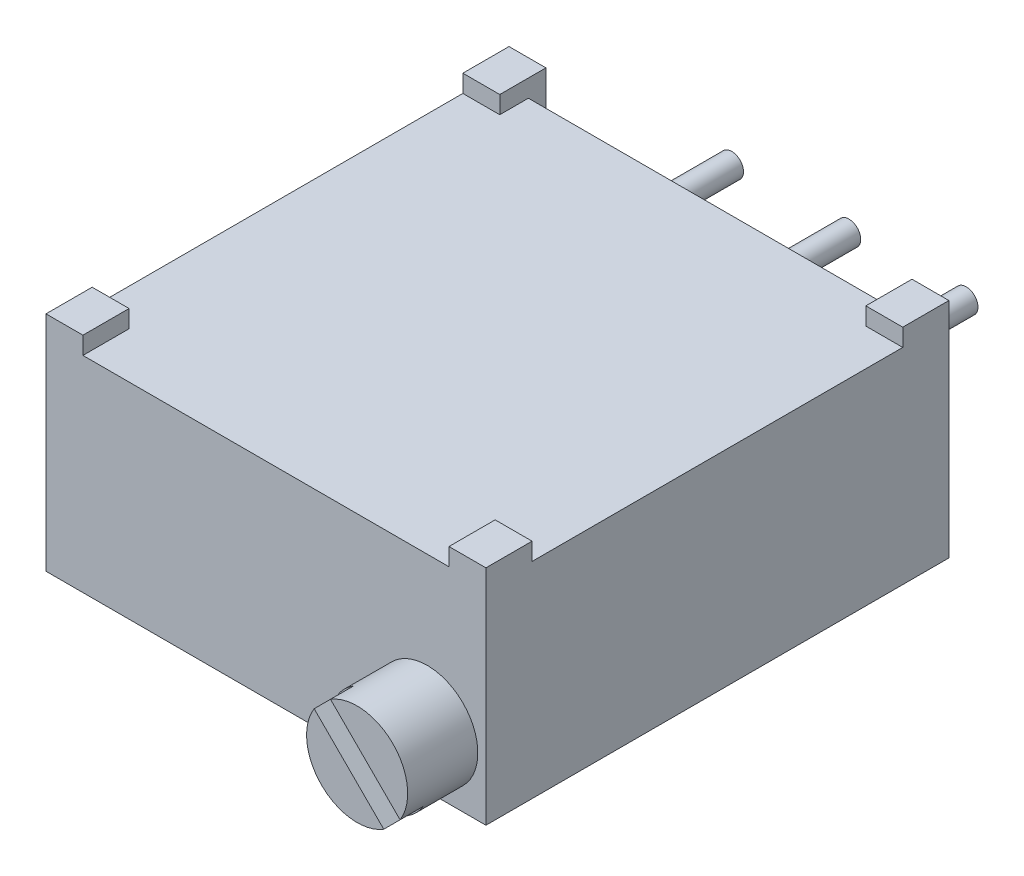
ISO-10303-21;
HEADER;
FILE_DESCRIPTION(('STEP AP214'),'2;1');
FILE_NAME('part.step','',(''),(''),'','','');
FILE_SCHEMA(('AUTOMOTIVE_DESIGN { 1 0 10303 214 1 1 1 1 }'));
ENDSEC;
DATA;
#1=APPLICATION_CONTEXT('core data for automotive mechanical design processes');
#2=APPLICATION_PROTOCOL_DEFINITION('international standard','automotive_design',2000,#1);
#3=PRODUCT_CONTEXT('',#1,'mechanical');
#4=PRODUCT('Part','Part','',(#3));
#5=PRODUCT_RELATED_PRODUCT_CATEGORY('part','',(#4));
#6=PRODUCT_DEFINITION_FORMATION('','',#4);
#7=PRODUCT_DEFINITION_CONTEXT('part definition',#1,'design');
#8=PRODUCT_DEFINITION('design','',#6,#7);
#9=PRODUCT_DEFINITION_SHAPE('','',#8);
#10=(LENGTH_UNIT() NAMED_UNIT(*) SI_UNIT(.MILLI.,.METRE.));
#11=(NAMED_UNIT(*) PLANE_ANGLE_UNIT() SI_UNIT($,.RADIAN.));
#12=(NAMED_UNIT(*) SI_UNIT($,.STERADIAN.) SOLID_ANGLE_UNIT());
#13=UNCERTAINTY_MEASURE_WITH_UNIT(LENGTH_MEASURE(1.E-05),#10,'distance_accuracy_value','');
#14=(GEOMETRIC_REPRESENTATION_CONTEXT(3) GLOBAL_UNCERTAINTY_ASSIGNED_CONTEXT((#13)) GLOBAL_UNIT_ASSIGNED_CONTEXT((#10,
#11,#12)) REPRESENTATION_CONTEXT('',''));
#15=CARTESIAN_POINT('',(0.,0.,0.));
#16=DIRECTION('',(0.,0.,1.));
#17=DIRECTION('',(1.,0.,0.));
#18=AXIS2_PLACEMENT_3D('',#15,#16,#17);
#19=CARTESIAN_POINT('',(3.495,-1.145,11.05));
#20=DIRECTION('',(0.,0.,1.));
#21=DIRECTION('',(1.,0.,0.));
#22=AXIS2_PLACEMENT_3D('',#19,#20,#21);
#23=PLANE('',#22);
#24=CARTESIAN_POINT('',(3.495,-1.145,11.05));
#25=DIRECTION('',(0.,0.,-1.));
#26=DIRECTION('',(-1.,0.,0.));
#27=AXIS2_PLACEMENT_3D('',#24,#25,#26);
#28=CIRCLE('',#27,1.095);
#29=CARTESIAN_POINT('',(4.07205518251167,-2.07560857310495,11.05));
#30=VERTEX_POINT('',#29);
#31=CARTESIAN_POINT('',(4.42560857310494,-1.72205518251167,11.05));
#32=VERTEX_POINT('',#31);
#33=EDGE_CURVE('E172',#30,#32,#28,.F.);
#34=ORIENTED_EDGE('',*,*,#33,.T.);
#35=DIRECTION('',(-0.707106781186546,0.707106781186549,0.));
#36=VECTOR('',#35,1.);
#37=CARTESIAN_POINT('',(2.91794481748833,-0.214391426895054,11.05));
#38=LINE('',#37,#36);
#39=CARTESIAN_POINT('',(2.91794481748833,-0.214391426895054,11.05));
#40=VERTEX_POINT('',#39);
#41=EDGE_CURVE('E175',#32,#40,#38,.T.);
#42=ORIENTED_EDGE('',*,*,#41,.T.);
#43=CARTESIAN_POINT('',(3.495,-1.145,11.05));
#44=DIRECTION('',(0.,0.,-1.));
#45=DIRECTION('',(-1.,0.,0.));
#46=AXIS2_PLACEMENT_3D('',#43,#44,#45);
#47=CIRCLE('',#46,1.095);
#48=CARTESIAN_POINT('',(2.56439142689505,-0.567944817488329,11.05));
#49=VERTEX_POINT('',#48);
#50=EDGE_CURVE('E19',#40,#49,#47,.F.);
#51=ORIENTED_EDGE('',*,*,#50,.T.);
#52=DIRECTION('',(0.707106781186546,-0.707106781186549,0.));
#53=VECTOR('',#52,1.);
#54=CARTESIAN_POINT('',(2.56439142689505,-0.567944817488327,11.05));
#55=LINE('',#54,#53);
#56=EDGE_CURVE('E193',#49,#30,#55,.T.);
#57=ORIENTED_EDGE('',*,*,#56,.T.);
#58=EDGE_LOOP('',(#34,#42,#51,#57));
#59=FACE_BOUND('',#58,.T.);
#60=ADVANCED_FACE('F16',(#59),#23,.T.);
#61=CARTESIAN_POINT('',(2.56439142689505,-0.567944817488327,11.05));
#62=DIRECTION('',(-0.707106781186549,-0.707106781186546,0.));
#63=DIRECTION('',(0.707106781186546,-0.707106781186549,0.));
#64=AXIS2_PLACEMENT_3D('',#61,#62,#63);
#65=PLANE('',#64);
#66=DIRECTION('',(0.,0.,1.));
#67=VECTOR('',#66,1.);
#68=CARTESIAN_POINT('',(4.07205518251167,-2.07560857310495,11.05));
#69=LINE('',#68,#67);
#70=CARTESIAN_POINT('',(4.07205518251167,-2.07560857310495,11.55));
#71=VERTEX_POINT('',#70);
#72=EDGE_CURVE('E191',#30,#71,#69,.T.);
#73=ORIENTED_EDGE('',*,*,#72,.F.);
#74=ORIENTED_EDGE('',*,*,#56,.F.);
#75=DIRECTION('',(0.,0.,1.));
#76=VECTOR('',#75,1.);
#77=CARTESIAN_POINT('',(2.56439142689505,-0.567944817488327,11.05));
#78=LINE('',#77,#76);
#79=CARTESIAN_POINT('',(2.56439142689505,-0.567944817488329,11.55));
#80=VERTEX_POINT('',#79);
#81=EDGE_CURVE('E168',#80,#49,#78,.F.);
#82=ORIENTED_EDGE('',*,*,#81,.F.);
#83=DIRECTION('',(-0.707106781186547,0.707106781186548,0.));
#84=VECTOR('',#83,1.);
#85=CARTESIAN_POINT('',(4.07205518251167,-2.07560857310495,11.55));
#86=LINE('',#85,#84);
#87=EDGE_CURVE('E184',#71,#80,#86,.T.);
#88=ORIENTED_EDGE('',*,*,#87,.F.);
#89=EDGE_LOOP('',(#73,#74,#82,#88));
#90=FACE_BOUND('',#89,.T.);
#91=ADVANCED_FACE('F242',(#90),#65,.F.);
#92=CARTESIAN_POINT('',(2.91794481748833,-0.214391426895054,11.05));
#93=DIRECTION('',(0.707106781186549,0.707106781186546,0.));
#94=DIRECTION('',(-0.707106781186546,0.707106781186549,0.));
#95=AXIS2_PLACEMENT_3D('',#92,#93,#94);
#96=PLANE('',#95);
#97=DIRECTION('',(0.,0.,1.));
#98=VECTOR('',#97,1.);
#99=CARTESIAN_POINT('',(2.91794481748833,-0.214391426895054,11.05));
#100=LINE('',#99,#98);
#101=CARTESIAN_POINT('',(2.91794481748833,-0.214391426895054,11.55));
#102=VERTEX_POINT('',#101);
#103=EDGE_CURVE('E165',#40,#102,#100,.T.);
#104=ORIENTED_EDGE('',*,*,#103,.F.);
#105=ORIENTED_EDGE('',*,*,#41,.F.);
#106=DIRECTION('',(0.,0.,1.));
#107=VECTOR('',#106,1.);
#108=CARTESIAN_POINT('',(4.42560857310494,-1.72205518251167,11.05));
#109=LINE('',#108,#107);
#110=CARTESIAN_POINT('',(4.42560857310494,-1.72205518251167,11.55));
#111=VERTEX_POINT('',#110);
#112=EDGE_CURVE('E178',#111,#32,#109,.F.);
#113=ORIENTED_EDGE('',*,*,#112,.F.);
#114=DIRECTION('',(0.707106781186546,-0.707106781186549,0.));
#115=VECTOR('',#114,1.);
#116=CARTESIAN_POINT('',(2.91794481748833,-0.214391426895054,11.55));
#117=LINE('',#116,#115);
#118=EDGE_CURVE('E182',#102,#111,#117,.T.);
#119=ORIENTED_EDGE('',*,*,#118,.F.);
#120=EDGE_LOOP('',(#104,#105,#113,#119));
#121=FACE_BOUND('',#120,.T.);
#122=ADVANCED_FACE('F180',(#121),#96,.F.);
#123=CARTESIAN_POINT('',(0.,0.0049999999999998,-2.6));
#124=DIRECTION('',(0.,0.,-1.));
#125=DIRECTION('',(-1.,0.,0.));
#126=AXIS2_PLACEMENT_3D('',#123,#124,#125);
#127=PLANE('',#126);
#128=CARTESIAN_POINT('',(0.,0.0049999999999998,-2.6));
#129=DIRECTION('',(0.,0.,1.));
#130=DIRECTION('',(1.,0.,0.));
#131=AXIS2_PLACEMENT_3D('',#128,#129,#130);
#132=CIRCLE('',#131,0.255);
#133=CARTESIAN_POINT('',(0.255,0.0049999999999998,-2.6));
#134=VERTEX_POINT('',#133);
#135=EDGE_CURVE('E224',#134,#134,#132,.T.);
#136=ORIENTED_EDGE('',*,*,#135,.F.);
#137=EDGE_LOOP('',(#136));
#138=FACE_BOUND('',#137,.T.);
#139=ADVANCED_FACE('F696',(#138),#127,.T.);
#140=CARTESIAN_POINT('',(-2.54,0.0049999999999998,-2.6));
#141=DIRECTION('',(0.,0.,-1.));
#142=DIRECTION('',(-1.,0.,0.));
#143=AXIS2_PLACEMENT_3D('',#140,#141,#142);
#144=PLANE('',#143);
#145=CARTESIAN_POINT('',(-2.54,0.0049999999999998,-2.6));
#146=DIRECTION('',(0.,0.,1.));
#147=DIRECTION('',(1.,0.,0.));
#148=AXIS2_PLACEMENT_3D('',#145,#146,#147);
#149=CIRCLE('',#148,0.255);
#150=CARTESIAN_POINT('',(-2.285,0.0049999999999998,-2.6));
#151=VERTEX_POINT('',#150);
#152=EDGE_CURVE('E221',#151,#151,#149,.T.);
#153=ORIENTED_EDGE('',*,*,#152,.F.);
#154=EDGE_LOOP('',(#153));
#155=FACE_BOUND('',#154,.T.);
#156=ADVANCED_FACE('F256',(#155),#144,.T.);
#157=CARTESIAN_POINT('',(2.54,0.00499999999999949,-2.6));
#158=DIRECTION('',(0.,0.,-1.));
#159=DIRECTION('',(-1.,0.,0.));
#160=AXIS2_PLACEMENT_3D('',#157,#158,#159);
#161=PLANE('',#160);
#162=CARTESIAN_POINT('',(2.54,0.00499999999999949,-2.6));
#163=DIRECTION('',(0.,0.,1.));
#164=DIRECTION('',(1.,0.,0.));
#165=AXIS2_PLACEMENT_3D('',#162,#163,#164);
#166=CIRCLE('',#165,0.255);
#167=CARTESIAN_POINT('',(2.795,0.00499999999999949,-2.6));
#168=VERTEX_POINT('',#167);
#169=EDGE_CURVE('E217',#168,#168,#166,.T.);
#170=ORIENTED_EDGE('',*,*,#169,.F.);
#171=EDGE_LOOP('',(#170));
#172=FACE_BOUND('',#171,.T.);
#173=ADVANCED_FACE('F247',(#172),#161,.T.);
#174=CARTESIAN_POINT('',(3.495,-1.145,11.55));
#175=DIRECTION('',(0.,0.,1.));
#176=DIRECTION('',(1.,0.,0.));
#177=AXIS2_PLACEMENT_3D('',#174,#175,#176);
#178=PLANE('',#177);
#179=ORIENTED_EDGE('',*,*,#87,.T.);
#180=CARTESIAN_POINT('',(3.495,-1.145,11.55));
#181=DIRECTION('',(0.,0.,-1.));
#182=DIRECTION('',(-1.,0.,0.));
#183=AXIS2_PLACEMENT_3D('',#180,#181,#182);
#184=CIRCLE('',#183,1.095);
#185=EDGE_CURVE('E214',#71,#80,#184,.T.);
#186=ORIENTED_EDGE('',*,*,#185,.F.);
#187=EDGE_LOOP('',(#179,#186));
#188=FACE_BOUND('',#187,.T.);
#189=ADVANCED_FACE('F245',(#188),#178,.T.);
#190=CARTESIAN_POINT('',(3.495,-1.145,11.55));
#191=DIRECTION('',(0.,0.,1.));
#192=DIRECTION('',(1.,0.,0.));
#193=AXIS2_PLACEMENT_3D('',#190,#191,#192);
#194=PLANE('',#193);
#195=ORIENTED_EDGE('',*,*,#118,.T.);
#196=CARTESIAN_POINT('',(3.495,-1.145,11.55));
#197=DIRECTION('',(0.,0.,-1.));
#198=DIRECTION('',(-1.,0.,0.));
#199=AXIS2_PLACEMENT_3D('',#196,#197,#198);
#200=CIRCLE('',#199,1.095);
#201=EDGE_CURVE('E212',#102,#111,#200,.T.);
#202=ORIENTED_EDGE('',*,*,#201,.F.);
#203=EDGE_LOOP('',(#195,#202));
#204=FACE_BOUND('',#203,.T.);
#205=ADVANCED_FACE('F238',(#204),#194,.T.);
#206=CARTESIAN_POINT('',(-3.965,2.416,-0.62));
#207=DIRECTION('',(-1.,0.,0.));
#208=DIRECTION('',(0.,0.,1.));
#209=AXIS2_PLACEMENT_3D('',#206,#207,#208);
#210=PLANE('',#209);
#211=DIRECTION('',(0.,0.,-1.));
#212=VECTOR('',#211,1.);
#213=CARTESIAN_POINT('',(-3.965,2.415,0.));
#214=LINE('',#213,#212);
#215=CARTESIAN_POINT('',(-3.965,2.415,0.));
#216=VERTEX_POINT('',#215);
#217=CARTESIAN_POINT('',(-3.965,2.415,1.));
#218=VERTEX_POINT('',#217);
#219=EDGE_CURVE('E354',#216,#218,#214,.F.);
#220=ORIENTED_EDGE('',*,*,#219,.T.);
#221=DIRECTION('',(0.,1.,0.));
#222=VECTOR('',#221,1.);
#223=CARTESIAN_POINT('',(-3.965,2.035,1.));
#224=LINE('',#223,#222);
#225=CARTESIAN_POINT('',(-3.965,2.035,1.));
#226=VERTEX_POINT('',#225);
#227=EDGE_CURVE('E357',#218,#226,#224,.F.);
#228=ORIENTED_EDGE('',*,*,#227,.T.);
#229=DIRECTION('',(0.,0.,1.));
#230=VECTOR('',#229,1.);
#231=CARTESIAN_POINT('',(-3.965,2.035,0.));
#232=LINE('',#231,#230);
#233=CARTESIAN_POINT('',(-3.965,2.035,0.38));
#234=VERTEX_POINT('',#233);
#235=EDGE_CURVE('E487',#234,#226,#232,.T.);
#236=ORIENTED_EDGE('',*,*,#235,.F.);
#237=DIRECTION('',(0.,1.,0.));
#238=VECTOR('',#237,1.);
#239=CARTESIAN_POINT('',(-3.965,2.416,0.38));
#240=LINE('',#239,#238);
#241=CARTESIAN_POINT('',(-3.965,-2.415,0.38));
#242=VERTEX_POINT('',#241);
#243=EDGE_CURVE('E461',#234,#242,#240,.F.);
#244=ORIENTED_EDGE('',*,*,#243,.T.);
#245=DIRECTION('',(0.,0.,1.));
#246=VECTOR('',#245,1.);
#247=CARTESIAN_POINT('',(-3.965,-2.415,-0.62));
#248=LINE('',#247,#246);
#249=CARTESIAN_POINT('',(-3.965,-2.415,0.));
#250=VERTEX_POINT('',#249);
#251=EDGE_CURVE('E229',#250,#242,#248,.T.);
#252=ORIENTED_EDGE('',*,*,#251,.F.);
#253=DIRECTION('',(0.,1.,0.));
#254=VECTOR('',#253,1.);
#255=CARTESIAN_POINT('',(-3.965,2.415,0.));
#256=LINE('',#255,#254);
#257=EDGE_CURVE('E360',#250,#216,#256,.T.);
#258=ORIENTED_EDGE('',*,*,#257,.T.);
#259=EDGE_LOOP('',(#220,#228,#236,#244,#252,#258));
#260=FACE_BOUND('',#259,.T.);
#261=ADVANCED_FACE('F254',(#260),#210,.F.);
#262=CARTESIAN_POINT('',(3.965,2.416,-0.619999999999999));
#263=DIRECTION('',(1.,0.,0.));
#264=DIRECTION('',(0.,0.,-1.));
#265=AXIS2_PLACEMENT_3D('',#262,#263,#264);
#266=PLANE('',#265);
#267=DIRECTION('',(0.,0.,-1.));
#268=VECTOR('',#267,1.);
#269=CARTESIAN_POINT('',(3.965,-2.415,-0.619999999999999));
#270=LINE('',#269,#268);
#271=CARTESIAN_POINT('',(3.965,-2.415,0.380000000000001));
#272=VERTEX_POINT('',#271);
#273=CARTESIAN_POINT('',(3.965,-2.415,0.));
#274=VERTEX_POINT('',#273);
#275=EDGE_CURVE('E226',#272,#274,#270,.T.);
#276=ORIENTED_EDGE('',*,*,#275,.F.);
#277=DIRECTION('',(0.,1.,0.));
#278=VECTOR('',#277,1.);
#279=CARTESIAN_POINT('',(3.965,2.416,0.380000000000001));
#280=LINE('',#279,#278);
#281=CARTESIAN_POINT('',(3.965,2.035,0.380000000000001));
#282=VERTEX_POINT('',#281);
#283=EDGE_CURVE('E459',#272,#282,#280,.T.);
#284=ORIENTED_EDGE('',*,*,#283,.T.);
#285=DIRECTION('',(0.,0.,1.));
#286=VECTOR('',#285,1.);
#287=CARTESIAN_POINT('',(3.965,2.035,0.));
#288=LINE('',#287,#286);
#289=CARTESIAN_POINT('',(3.965,2.035,1.));
#290=VERTEX_POINT('',#289);
#291=EDGE_CURVE('E370',#290,#282,#288,.F.);
#292=ORIENTED_EDGE('',*,*,#291,.F.);
#293=DIRECTION('',(0.,1.,0.));
#294=VECTOR('',#293,1.);
#295=CARTESIAN_POINT('',(3.965,2.035,1.));
#296=LINE('',#295,#294);
#297=CARTESIAN_POINT('',(3.965,2.415,1.));
#298=VERTEX_POINT('',#297);
#299=EDGE_CURVE('E395',#290,#298,#296,.T.);
#300=ORIENTED_EDGE('',*,*,#299,.T.);
#301=DIRECTION('',(0.,0.,-1.));
#302=VECTOR('',#301,1.);
#303=CARTESIAN_POINT('',(3.965,2.415,0.));
#304=LINE('',#303,#302);
#305=CARTESIAN_POINT('',(3.965,2.415,0.));
#306=VERTEX_POINT('',#305);
#307=EDGE_CURVE('E387',#298,#306,#304,.T.);
#308=ORIENTED_EDGE('',*,*,#307,.T.);
#309=DIRECTION('',(0.,1.,0.));
#310=VECTOR('',#309,1.);
#311=CARTESIAN_POINT('',(3.965,2.415,0.));
#312=LINE('',#311,#310);
#313=EDGE_CURVE('E220',#306,#274,#312,.F.);
#314=ORIENTED_EDGE('',*,*,#313,.T.);
#315=EDGE_LOOP('',(#276,#284,#292,#300,#308,#314));
#316=FACE_BOUND('',#315,.T.);
#317=ADVANCED_FACE('F345',(#316),#266,.F.);
#318=CARTESIAN_POINT('',(0.,0.0049999999999998,-2.6));
#319=DIRECTION('',(0.,0.,1.));
#320=DIRECTION('',(1.,0.,0.));
#321=AXIS2_PLACEMENT_3D('',#318,#319,#320);
#322=CYLINDRICAL_SURFACE('',#321,0.255);
#323=ORIENTED_EDGE('',*,*,#135,.T.);
#324=EDGE_LOOP('',(#323));
#325=FACE_BOUND('',#324,.T.);
#326=CARTESIAN_POINT('',(0.,0.0049999999999998,0.380000000000001));
#327=DIRECTION('',(0.,0.,1.));
#328=DIRECTION('',(1.,0.,0.));
#329=AXIS2_PLACEMENT_3D('',#326,#327,#328);
#330=CIRCLE('',#329,0.255);
#331=CARTESIAN_POINT('',(0.255,0.0049999999999998,0.380000000000001));
#332=VERTEX_POINT('',#331);
#333=EDGE_CURVE('E208',#332,#332,#330,.F.);
#334=ORIENTED_EDGE('',*,*,#333,.T.);
#335=EDGE_LOOP('',(#334));
#336=FACE_BOUND('',#335,.T.);
#337=ADVANCED_FACE('F341',(#325,#336),#322,.T.);
#338=CARTESIAN_POINT('',(-2.54,0.0049999999999998,-2.6));
#339=DIRECTION('',(0.,0.,1.));
#340=DIRECTION('',(1.,0.,0.));
#341=AXIS2_PLACEMENT_3D('',#338,#339,#340);
#342=CYLINDRICAL_SURFACE('',#341,0.255);
#343=ORIENTED_EDGE('',*,*,#152,.T.);
#344=EDGE_LOOP('',(#343));
#345=FACE_BOUND('',#344,.T.);
#346=CARTESIAN_POINT('',(-2.54,0.0049999999999998,0.38));
#347=DIRECTION('',(0.,0.,1.));
#348=DIRECTION('',(1.,0.,0.));
#349=AXIS2_PLACEMENT_3D('',#346,#347,#348);
#350=CIRCLE('',#349,0.255);
#351=CARTESIAN_POINT('',(-2.285,0.0049999999999998,0.38));
#352=VERTEX_POINT('',#351);
#353=EDGE_CURVE('E205',#352,#352,#350,.F.);
#354=ORIENTED_EDGE('',*,*,#353,.T.);
#355=EDGE_LOOP('',(#354));
#356=FACE_BOUND('',#355,.T.);
#357=ADVANCED_FACE('F337',(#345,#356),#342,.T.);
#358=CARTESIAN_POINT('',(2.54,0.00499999999999949,-2.6));
#359=DIRECTION('',(0.,0.,1.));
#360=DIRECTION('',(1.,0.,0.));
#361=AXIS2_PLACEMENT_3D('',#358,#359,#360);
#362=CYLINDRICAL_SURFACE('',#361,0.255);
#363=ORIENTED_EDGE('',*,*,#169,.T.);
#364=EDGE_LOOP('',(#363));
#365=FACE_BOUND('',#364,.T.);
#366=CARTESIAN_POINT('',(2.54,0.00499999999999949,0.380000000000001));
#367=DIRECTION('',(0.,0.,1.));
#368=DIRECTION('',(1.,0.,0.));
#369=AXIS2_PLACEMENT_3D('',#366,#367,#368);
#370=CIRCLE('',#369,0.255);
#371=CARTESIAN_POINT('',(2.795,0.00499999999999949,0.380000000000001));
#372=VERTEX_POINT('',#371);
#373=EDGE_CURVE('E201',#372,#372,#370,.F.);
#374=ORIENTED_EDGE('',*,*,#373,.T.);
#375=EDGE_LOOP('',(#374));
#376=FACE_BOUND('',#375,.T.);
#377=ADVANCED_FACE('F333',(#365,#376),#362,.T.);
#378=CARTESIAN_POINT('',(-4.765,2.415,0.));
#379=DIRECTION('',(0.,0.,1.));
#380=DIRECTION('',(1.,0.,0.));
#381=AXIS2_PLACEMENT_3D('',#378,#379,#380);
#382=PLANE('',#381);
#383=ORIENTED_EDGE('',*,*,#313,.F.);
#384=DIRECTION('',(1.,0.,0.));
#385=VECTOR('',#384,1.);
#386=CARTESIAN_POINT('',(0.,2.415,0.));
#387=LINE('',#386,#385);
#388=CARTESIAN_POINT('',(4.765,2.415,0.));
#389=VERTEX_POINT('',#388);
#390=EDGE_CURVE('E393',#306,#389,#387,.T.);
#391=ORIENTED_EDGE('',*,*,#390,.T.);
#392=DIRECTION('',(0.,1.,0.));
#393=VECTOR('',#392,1.);
#394=CARTESIAN_POINT('',(4.765,2.415,0.));
#395=LINE('',#394,#393);
#396=CARTESIAN_POINT('',(4.765,-2.415,0.));
#397=VERTEX_POINT('',#396);
#398=EDGE_CURVE('E204',#389,#397,#395,.F.);
#399=ORIENTED_EDGE('',*,*,#398,.T.);
#400=DIRECTION('',(1.,0.,0.));
#401=VECTOR('',#400,1.);
#402=CARTESIAN_POINT('',(-4.765,-2.415,0.));
#403=LINE('',#402,#401);
#404=EDGE_CURVE('E396',#274,#397,#403,.T.);
#405=ORIENTED_EDGE('',*,*,#404,.F.);
#406=EDGE_LOOP('',(#383,#391,#399,#405));
#407=FACE_BOUND('',#406,.T.);
#408=ADVANCED_FACE('F329',(#407),#382,.F.);
#409=CARTESIAN_POINT('',(3.965,2.035,9.03));
#410=DIRECTION('',(0.,0.,1.));
#411=DIRECTION('',(1.,0.,0.));
#412=AXIS2_PLACEMENT_3D('',#409,#410,#411);
#413=PLANE('',#412);
#414=DIRECTION('',(0.,1.,0.));
#415=VECTOR('',#414,1.);
#416=CARTESIAN_POINT('',(4.765,2.415,9.03));
#417=LINE('',#416,#415);
#418=CARTESIAN_POINT('',(4.765,2.415,9.03));
#419=VERTEX_POINT('',#418);
#420=CARTESIAN_POINT('',(4.765,2.035,9.03));
#421=VERTEX_POINT('',#420);
#422=EDGE_CURVE('E453',#419,#421,#417,.F.);
#423=ORIENTED_EDGE('',*,*,#422,.T.);
#424=DIRECTION('',(1.,0.,0.));
#425=VECTOR('',#424,1.);
#426=CARTESIAN_POINT('',(0.,2.035,9.03));
#427=LINE('',#426,#425);
#428=CARTESIAN_POINT('',(3.965,2.035,9.03));
#429=VERTEX_POINT('',#428);
#430=EDGE_CURVE('E477',#429,#421,#427,.T.);
#431=ORIENTED_EDGE('',*,*,#430,.F.);
#432=DIRECTION('',(0.,1.,0.));
#433=VECTOR('',#432,1.);
#434=CARTESIAN_POINT('',(3.965,2.035,9.03));
#435=LINE('',#434,#433);
#436=CARTESIAN_POINT('',(3.965,2.415,9.03));
#437=VERTEX_POINT('',#436);
#438=EDGE_CURVE('E385',#429,#437,#435,.T.);
#439=ORIENTED_EDGE('',*,*,#438,.T.);
#440=DIRECTION('',(1.,0.,0.));
#441=VECTOR('',#440,1.);
#442=CARTESIAN_POINT('',(0.,2.415,9.03));
#443=LINE('',#442,#441);
#444=EDGE_CURVE('E216',#437,#419,#443,.T.);
#445=ORIENTED_EDGE('',*,*,#444,.T.);
#446=EDGE_LOOP('',(#423,#431,#439,#445));
#447=FACE_BOUND('',#446,.T.);
#448=ADVANCED_FACE('F325',(#447),#413,.F.);
#449=CARTESIAN_POINT('',(4.765,2.035,0.999999999999999));
#450=DIRECTION('',(0.,0.,-1.));
#451=DIRECTION('',(-1.,0.,0.));
#452=AXIS2_PLACEMENT_3D('',#449,#450,#451);
#453=PLANE('',#452);
#454=ORIENTED_EDGE('',*,*,#299,.F.);
#455=DIRECTION('',(1.,0.,0.));
#456=VECTOR('',#455,1.);
#457=CARTESIAN_POINT('',(0.,2.035,0.999999999999999));
#458=LINE('',#457,#456);
#459=CARTESIAN_POINT('',(4.765,2.035,0.999999999999999));
#460=VERTEX_POINT('',#459);
#461=EDGE_CURVE('E474',#460,#290,#458,.F.);
#462=ORIENTED_EDGE('',*,*,#461,.F.);
#463=DIRECTION('',(0.,1.,0.));
#464=VECTOR('',#463,1.);
#465=CARTESIAN_POINT('',(4.765,2.415,0.999999999999999));
#466=LINE('',#465,#464);
#467=CARTESIAN_POINT('',(4.765,2.415,0.999999999999999));
#468=VERTEX_POINT('',#467);
#469=EDGE_CURVE('E448',#460,#468,#466,.T.);
#470=ORIENTED_EDGE('',*,*,#469,.T.);
#471=DIRECTION('',(1.,0.,0.));
#472=VECTOR('',#471,1.);
#473=CARTESIAN_POINT('',(0.,2.415,0.999999999999999));
#474=LINE('',#473,#472);
#475=EDGE_CURVE('E390',#468,#298,#474,.F.);
#476=ORIENTED_EDGE('',*,*,#475,.T.);
#477=EDGE_LOOP('',(#454,#462,#470,#476));
#478=FACE_BOUND('',#477,.T.);
#479=ADVANCED_FACE('F321',(#478),#453,.F.);
#480=CARTESIAN_POINT('',(0.,2.415,0.));
#481=DIRECTION('',(0.,-1.,0.));
#482=DIRECTION('',(0.,0.,-1.));
#483=AXIS2_PLACEMENT_3D('',#480,#481,#482);
#484=PLANE('',#483);
#485=ORIENTED_EDGE('',*,*,#475,.F.);
#486=DIRECTION('',(0.,0.,1.));
#487=VECTOR('',#486,1.);
#488=CARTESIAN_POINT('',(4.765,2.415,10.03));
#489=LINE('',#488,#487);
#490=EDGE_CURVE('E446',#468,#389,#489,.F.);
#491=ORIENTED_EDGE('',*,*,#490,.T.);
#492=ORIENTED_EDGE('',*,*,#390,.F.);
#493=ORIENTED_EDGE('',*,*,#307,.F.);
#494=EDGE_LOOP('',(#485,#491,#492,#493));
#495=FACE_BOUND('',#494,.T.);
#496=ADVANCED_FACE('F317',(#495),#484,.F.);
#497=CARTESIAN_POINT('',(-3.965,2.035,9.03));
#498=DIRECTION('',(-1.,0.,0.));
#499=DIRECTION('',(0.,0.,1.));
#500=AXIS2_PLACEMENT_3D('',#497,#498,#499);
#501=PLANE('',#500);
#502=DIRECTION('',(0.,1.,0.));
#503=VECTOR('',#502,1.);
#504=CARTESIAN_POINT('',(-3.965,2.415,10.03));
#505=LINE('',#504,#503);
#506=CARTESIAN_POINT('',(-3.965,2.415,10.03));
#507=VERTEX_POINT('',#506);
#508=CARTESIAN_POINT('',(-3.965,2.035,10.03));
#509=VERTEX_POINT('',#508);
#510=EDGE_CURVE('E440',#507,#509,#505,.F.);
#511=ORIENTED_EDGE('',*,*,#510,.T.);
#512=DIRECTION('',(0.,0.,1.));
#513=VECTOR('',#512,1.);
#514=CARTESIAN_POINT('',(-3.965,2.035,0.));
#515=LINE('',#514,#513);
#516=CARTESIAN_POINT('',(-3.965,2.035,9.03));
#517=VERTEX_POINT('',#516);
#518=EDGE_CURVE('E483',#517,#509,#515,.T.);
#519=ORIENTED_EDGE('',*,*,#518,.F.);
#520=DIRECTION('',(0.,1.,0.));
#521=VECTOR('',#520,1.);
#522=CARTESIAN_POINT('',(-3.965,2.035,9.03));
#523=LINE('',#522,#521);
#524=CARTESIAN_POINT('',(-3.965,2.415,9.03));
#525=VERTEX_POINT('',#524);
#526=EDGE_CURVE('E469',#517,#525,#523,.T.);
#527=ORIENTED_EDGE('',*,*,#526,.T.);
#528=DIRECTION('',(0.,0.,-1.));
#529=VECTOR('',#528,1.);
#530=CARTESIAN_POINT('',(-3.965,2.415,0.));
#531=LINE('',#530,#529);
#532=EDGE_CURVE('E464',#525,#507,#531,.F.);
#533=ORIENTED_EDGE('',*,*,#532,.T.);
#534=EDGE_LOOP('',(#511,#519,#527,#533));
#535=FACE_BOUND('',#534,.T.);
#536=ADVANCED_FACE('F313',(#535),#501,.F.);
#537=CARTESIAN_POINT('',(3.965,2.035,10.03));
#538=DIRECTION('',(1.,0.,0.));
#539=DIRECTION('',(0.,0.,-1.));
#540=AXIS2_PLACEMENT_3D('',#537,#538,#539);
#541=PLANE('',#540);
#542=ORIENTED_EDGE('',*,*,#438,.F.);
#543=DIRECTION('',(0.,0.,1.));
#544=VECTOR('',#543,1.);
#545=CARTESIAN_POINT('',(3.965,2.035,0.));
#546=LINE('',#545,#544);
#547=CARTESIAN_POINT('',(3.965,2.035,10.03));
#548=VERTEX_POINT('',#547);
#549=EDGE_CURVE('E480',#548,#429,#546,.F.);
#550=ORIENTED_EDGE('',*,*,#549,.F.);
#551=DIRECTION('',(0.,1.,0.));
#552=VECTOR('',#551,1.);
#553=CARTESIAN_POINT('',(3.965,2.415,10.03));
#554=LINE('',#553,#552);
#555=CARTESIAN_POINT('',(3.965,2.415,10.03));
#556=VERTEX_POINT('',#555);
#557=EDGE_CURVE('E435',#548,#556,#554,.T.);
#558=ORIENTED_EDGE('',*,*,#557,.T.);
#559=DIRECTION('',(0.,0.,-1.));
#560=VECTOR('',#559,1.);
#561=CARTESIAN_POINT('',(3.965,2.415,0.));
#562=LINE('',#561,#560);
#563=EDGE_CURVE('E382',#556,#437,#562,.T.);
#564=ORIENTED_EDGE('',*,*,#563,.T.);
#565=EDGE_LOOP('',(#542,#550,#558,#564));
#566=FACE_BOUND('',#565,.T.);
#567=ADVANCED_FACE('F309',(#566),#541,.F.);
#568=CARTESIAN_POINT('',(0.,2.415,0.));
#569=DIRECTION('',(0.,-1.,0.));
#570=DIRECTION('',(0.,0.,-1.));
#571=AXIS2_PLACEMENT_3D('',#568,#569,#570);
#572=PLANE('',#571);
#573=ORIENTED_EDGE('',*,*,#444,.F.);
#574=ORIENTED_EDGE('',*,*,#563,.F.);
#575=DIRECTION('',(-1.,0.,0.));
#576=VECTOR('',#575,1.);
#577=CARTESIAN_POINT('',(-4.765,2.415,10.03));
#578=LINE('',#577,#576);
#579=CARTESIAN_POINT('',(4.765,2.415,10.03));
#580=VERTEX_POINT('',#579);
#581=EDGE_CURVE('E200',#556,#580,#578,.F.);
#582=ORIENTED_EDGE('',*,*,#581,.T.);
#583=DIRECTION('',(0.,0.,1.));
#584=VECTOR('',#583,1.);
#585=CARTESIAN_POINT('',(4.765,2.415,10.03));
#586=LINE('',#585,#584);
#587=EDGE_CURVE('E407',#580,#419,#586,.F.);
#588=ORIENTED_EDGE('',*,*,#587,.T.);
#589=EDGE_LOOP('',(#573,#574,#582,#588));
#590=FACE_BOUND('',#589,.T.);
#591=ADVANCED_FACE('F306',(#590),#572,.F.);
#592=CARTESIAN_POINT('',(3.495,-1.145,11.55));
#593=DIRECTION('',(0.,0.,-1.));
#594=DIRECTION('',(-1.,0.,0.));
#595=AXIS2_PLACEMENT_3D('',#592,#593,#594);
#596=CYLINDRICAL_SURFACE('',#595,1.095);
#597=ORIENTED_EDGE('',*,*,#201,.T.);
#598=ORIENTED_EDGE('',*,*,#112,.T.);
#599=ORIENTED_EDGE('',*,*,#33,.F.);
#600=ORIENTED_EDGE('',*,*,#72,.T.);
#601=ORIENTED_EDGE('',*,*,#185,.T.);
#602=ORIENTED_EDGE('',*,*,#81,.T.);
#603=ORIENTED_EDGE('',*,*,#50,.F.);
#604=ORIENTED_EDGE('',*,*,#103,.T.);
#605=EDGE_LOOP('',(#597,#598,#599,#600,#601,#602,#603,#604));
#606=FACE_BOUND('',#605,.T.);
#607=CARTESIAN_POINT('',(3.495,-1.145,10.03));
#608=DIRECTION('',(0.,0.,-1.));
#609=DIRECTION('',(-1.,0.,0.));
#610=AXIS2_PLACEMENT_3D('',#607,#608,#609);
#611=CIRCLE('',#610,1.095);
#612=CARTESIAN_POINT('',(2.4,-1.145,10.03));
#613=VERTEX_POINT('',#612);
#614=EDGE_CURVE('E196',#613,#613,#611,.F.);
#615=ORIENTED_EDGE('',*,*,#614,.T.);
#616=EDGE_LOOP('',(#615));
#617=FACE_BOUND('',#616,.T.);
#618=ADVANCED_FACE('F162',(#606,#617),#596,.T.);
#619=CARTESIAN_POINT('',(-4.765,2.415,0.));
#620=DIRECTION('',(0.,0.,1.));
#621=DIRECTION('',(1.,0.,0.));
#622=AXIS2_PLACEMENT_3D('',#619,#620,#621);
#623=PLANE('',#622);
#624=ORIENTED_EDGE('',*,*,#257,.F.);
#625=DIRECTION('',(1.,0.,0.));
#626=VECTOR('',#625,1.);
#627=CARTESIAN_POINT('',(-4.765,-2.415,0.));
#628=LINE('',#627,#626);
#629=CARTESIAN_POINT('',(-4.765,-2.415,0.));
#630=VERTEX_POINT('',#629);
#631=EDGE_CURVE('E34',#630,#250,#628,.T.);
#632=ORIENTED_EDGE('',*,*,#631,.F.);
#633=DIRECTION('',(0.,1.,0.));
#634=VECTOR('',#633,1.);
#635=CARTESIAN_POINT('',(-4.765,2.415,0.));
#636=LINE('',#635,#634);
#637=CARTESIAN_POINT('',(-4.765,2.415,0.));
#638=VERTEX_POINT('',#637);
#639=EDGE_CURVE('E430',#630,#638,#636,.T.);
#640=ORIENTED_EDGE('',*,*,#639,.T.);
#641=DIRECTION('',(1.,0.,0.));
#642=VECTOR('',#641,1.);
#643=CARTESIAN_POINT('',(0.,2.415,0.));
#644=LINE('',#643,#642);
#645=EDGE_CURVE('E363',#638,#216,#644,.T.);
#646=ORIENTED_EDGE('',*,*,#645,.T.);
#647=EDGE_LOOP('',(#624,#632,#640,#646));
#648=FACE_BOUND('',#647,.T.);
#649=ADVANCED_FACE('F300',(#648),#623,.F.);
#650=CARTESIAN_POINT('',(0.,2.415,0.));
#651=DIRECTION('',(0.,-1.,0.));
#652=DIRECTION('',(0.,0.,-1.));
#653=AXIS2_PLACEMENT_3D('',#650,#651,#652);
#654=PLANE('',#653);
#655=DIRECTION('',(-1.,0.,0.));
#656=VECTOR('',#655,1.);
#657=CARTESIAN_POINT('',(-3.965,2.415,1.));
#658=LINE('',#657,#656);
#659=CARTESIAN_POINT('',(-4.765,2.415,1.));
#660=VERTEX_POINT('',#659);
#661=EDGE_CURVE('E366',#660,#218,#658,.F.);
#662=ORIENTED_EDGE('',*,*,#661,.T.);
#663=ORIENTED_EDGE('',*,*,#219,.F.);
#664=ORIENTED_EDGE('',*,*,#645,.F.);
#665=DIRECTION('',(0.,0.,-1.));
#666=VECTOR('',#665,1.);
#667=CARTESIAN_POINT('',(-4.765,2.415,10.03));
#668=LINE('',#667,#666);
#669=EDGE_CURVE('E368',#638,#660,#668,.F.);
#670=ORIENTED_EDGE('',*,*,#669,.T.);
#671=EDGE_LOOP('',(#662,#663,#664,#670));
#672=FACE_BOUND('',#671,.T.);
#673=ADVANCED_FACE('F296',(#672),#654,.F.);
#674=CARTESIAN_POINT('',(-3.965,2.035,1.));
#675=DIRECTION('',(0.,0.,-1.));
#676=DIRECTION('',(-1.,0.,0.));
#677=AXIS2_PLACEMENT_3D('',#674,#675,#676);
#678=PLANE('',#677);
#679=DIRECTION('',(0.,1.,0.));
#680=VECTOR('',#679,1.);
#681=CARTESIAN_POINT('',(-4.765,2.415,0.999999999999999));
#682=LINE('',#681,#680);
#683=CARTESIAN_POINT('',(-4.765,2.035,1.));
#684=VERTEX_POINT('',#683);
#685=EDGE_CURVE('E427',#660,#684,#682,.F.);
#686=ORIENTED_EDGE('',*,*,#685,.T.);
#687=DIRECTION('',(1.,0.,0.));
#688=VECTOR('',#687,1.);
#689=CARTESIAN_POINT('',(0.,2.035,1.));
#690=LINE('',#689,#688);
#691=EDGE_CURVE('E373',#226,#684,#690,.F.);
#692=ORIENTED_EDGE('',*,*,#691,.F.);
#693=ORIENTED_EDGE('',*,*,#227,.F.);
#694=ORIENTED_EDGE('',*,*,#661,.F.);
#695=EDGE_LOOP('',(#686,#692,#693,#694));
#696=FACE_BOUND('',#695,.T.);
#697=ADVANCED_FACE('F292',(#696),#678,.F.);
#698=CARTESIAN_POINT('',(0.,2.035,0.));
#699=DIRECTION('',(0.,1.,0.));
#700=DIRECTION('',(0.,0.,1.));
#701=AXIS2_PLACEMENT_3D('',#698,#699,#700);
#702=PLANE('',#701);
#703=DIRECTION('',(0.,0.,1.));
#704=VECTOR('',#703,1.);
#705=CARTESIAN_POINT('',(4.765,2.035,10.03));
#706=LINE('',#705,#704);
#707=EDGE_CURVE('E450',#421,#460,#706,.F.);
#708=ORIENTED_EDGE('',*,*,#707,.T.);
#709=ORIENTED_EDGE('',*,*,#461,.T.);
#710=ORIENTED_EDGE('',*,*,#291,.T.);
#711=DIRECTION('',(1.,0.,0.));
#712=VECTOR('',#711,1.);
#713=CARTESIAN_POINT('',(-3.965,2.035,0.38));
#714=LINE('',#713,#712);
#715=EDGE_CURVE('E211',#282,#234,#714,.F.);
#716=ORIENTED_EDGE('',*,*,#715,.T.);
#717=ORIENTED_EDGE('',*,*,#235,.T.);
#718=ORIENTED_EDGE('',*,*,#691,.T.);
#719=DIRECTION('',(0.,0.,-1.));
#720=VECTOR('',#719,1.);
#721=CARTESIAN_POINT('',(-4.765,2.035,10.03));
#722=LINE('',#721,#720);
#723=CARTESIAN_POINT('',(-4.765,2.035,9.03));
#724=VERTEX_POINT('',#723);
#725=EDGE_CURVE('E425',#684,#724,#722,.F.);
#726=ORIENTED_EDGE('',*,*,#725,.T.);
#727=DIRECTION('',(1.,0.,0.));
#728=VECTOR('',#727,1.);
#729=CARTESIAN_POINT('',(-4.765,2.035,9.03));
#730=LINE('',#729,#728);
#731=EDGE_CURVE('E471',#724,#517,#730,.T.);
#732=ORIENTED_EDGE('',*,*,#731,.T.);
#733=ORIENTED_EDGE('',*,*,#518,.T.);
#734=DIRECTION('',(-1.,0.,0.));
#735=VECTOR('',#734,1.);
#736=CARTESIAN_POINT('',(-4.765,2.035,10.03));
#737=LINE('',#736,#735);
#738=EDGE_CURVE('E437',#509,#548,#737,.F.);
#739=ORIENTED_EDGE('',*,*,#738,.T.);
#740=ORIENTED_EDGE('',*,*,#549,.T.);
#741=ORIENTED_EDGE('',*,*,#430,.T.);
#742=EDGE_LOOP('',(#708,#709,#710,#716,#717,#718,#726,#732,#733,#739,#740,#741));
#743=FACE_BOUND('',#742,.T.);
#744=ADVANCED_FACE('F288',(#743),#702,.T.);
#745=CARTESIAN_POINT('',(-4.765,2.035,9.03));
#746=DIRECTION('',(0.,0.,1.));
#747=DIRECTION('',(1.,0.,0.));
#748=AXIS2_PLACEMENT_3D('',#745,#746,#747);
#749=PLANE('',#748);
#750=ORIENTED_EDGE('',*,*,#526,.F.);
#751=ORIENTED_EDGE('',*,*,#731,.F.);
#752=DIRECTION('',(0.,1.,0.));
#753=VECTOR('',#752,1.);
#754=CARTESIAN_POINT('',(-4.765,2.415,9.03));
#755=LINE('',#754,#753);
#756=CARTESIAN_POINT('',(-4.765,2.415,9.03));
#757=VERTEX_POINT('',#756);
#758=EDGE_CURVE('E423',#724,#757,#755,.T.);
#759=ORIENTED_EDGE('',*,*,#758,.T.);
#760=DIRECTION('',(1.,0.,0.));
#761=VECTOR('',#760,1.);
#762=CARTESIAN_POINT('',(0.,2.415,9.03));
#763=LINE('',#762,#761);
#764=EDGE_CURVE('E466',#757,#525,#763,.T.);
#765=ORIENTED_EDGE('',*,*,#764,.T.);
#766=EDGE_LOOP('',(#750,#751,#759,#765));
#767=FACE_BOUND('',#766,.T.);
#768=ADVANCED_FACE('F284',(#767),#749,.F.);
#769=CARTESIAN_POINT('',(0.,2.415,0.));
#770=DIRECTION('',(0.,-1.,0.));
#771=DIRECTION('',(0.,0.,-1.));
#772=AXIS2_PLACEMENT_3D('',#769,#770,#771);
#773=PLANE('',#772);
#774=ORIENTED_EDGE('',*,*,#532,.F.);
#775=ORIENTED_EDGE('',*,*,#764,.F.);
#776=DIRECTION('',(0.,0.,-1.));
#777=VECTOR('',#776,1.);
#778=CARTESIAN_POINT('',(-4.765,2.415,10.03));
#779=LINE('',#778,#777);
#780=CARTESIAN_POINT('',(-4.765,2.415,10.03));
#781=VERTEX_POINT('',#780);
#782=EDGE_CURVE('E418',#757,#781,#779,.F.);
#783=ORIENTED_EDGE('',*,*,#782,.T.);
#784=DIRECTION('',(-1.,0.,0.));
#785=VECTOR('',#784,1.);
#786=CARTESIAN_POINT('',(-4.765,2.415,10.03));
#787=LINE('',#786,#785);
#788=EDGE_CURVE('E442',#781,#507,#787,.F.);
#789=ORIENTED_EDGE('',*,*,#788,.T.);
#790=EDGE_LOOP('',(#774,#775,#783,#789));
#791=FACE_BOUND('',#790,.T.);
#792=ADVANCED_FACE('F280',(#791),#773,.F.);
#793=CARTESIAN_POINT('',(-3.965,2.416,0.38));
#794=DIRECTION('',(0.,0.,1.));
#795=DIRECTION('',(1.,0.,0.));
#796=AXIS2_PLACEMENT_3D('',#793,#794,#795);
#797=PLANE('',#796);
#798=ORIENTED_EDGE('',*,*,#373,.F.);
#799=EDGE_LOOP('',(#798));
#800=FACE_BOUND('',#799,.T.);
#801=ORIENTED_EDGE('',*,*,#353,.F.);
#802=EDGE_LOOP('',(#801));
#803=FACE_BOUND('',#802,.T.);
#804=ORIENTED_EDGE('',*,*,#333,.F.);
#805=EDGE_LOOP('',(#804));
#806=FACE_BOUND('',#805,.T.);
#807=ORIENTED_EDGE('',*,*,#283,.F.);
#808=DIRECTION('',(1.,0.,0.));
#809=VECTOR('',#808,1.);
#810=CARTESIAN_POINT('',(0.,-2.415,0.38));
#811=LINE('',#810,#809);
#812=EDGE_CURVE('E415',#242,#272,#811,.T.);
#813=ORIENTED_EDGE('',*,*,#812,.F.);
#814=ORIENTED_EDGE('',*,*,#243,.F.);
#815=ORIENTED_EDGE('',*,*,#715,.F.);
#816=EDGE_LOOP('',(#807,#813,#814,#815));
#817=FACE_BOUND('',#816,.T.);
#818=ADVANCED_FACE('F276',(#800,#803,#806,#817),#797,.F.);
#819=CARTESIAN_POINT('',(4.765,2.415,10.03));
#820=DIRECTION('',(-1.,0.,0.));
#821=DIRECTION('',(0.,0.,1.));
#822=AXIS2_PLACEMENT_3D('',#819,#820,#821);
#823=PLANE('',#822);
#824=ORIENTED_EDGE('',*,*,#469,.F.);
#825=ORIENTED_EDGE('',*,*,#707,.F.);
#826=ORIENTED_EDGE('',*,*,#422,.F.);
#827=ORIENTED_EDGE('',*,*,#587,.F.);
#828=DIRECTION('',(0.,1.,0.));
#829=VECTOR('',#828,1.);
#830=CARTESIAN_POINT('',(4.765,2.415,10.03));
#831=LINE('',#830,#829);
#832=CARTESIAN_POINT('',(4.765,-2.415,10.03));
#833=VERTEX_POINT('',#832);
#834=EDGE_CURVE('E412',#580,#833,#831,.F.);
#835=ORIENTED_EDGE('',*,*,#834,.T.);
#836=DIRECTION('',(0.,0.,-1.));
#837=VECTOR('',#836,1.);
#838=CARTESIAN_POINT('',(4.765,-2.415,0.));
#839=LINE('',#838,#837);
#840=EDGE_CURVE('E409',#397,#833,#839,.F.);
#841=ORIENTED_EDGE('',*,*,#840,.F.);
#842=ORIENTED_EDGE('',*,*,#398,.F.);
#843=ORIENTED_EDGE('',*,*,#490,.F.);
#844=EDGE_LOOP('',(#824,#825,#826,#827,#835,#841,#842,#843));
#845=FACE_BOUND('',#844,.T.);
#846=ADVANCED_FACE('F272',(#845),#823,.F.);
#847=CARTESIAN_POINT('',(-4.765,2.415,10.03));
#848=DIRECTION('',(0.,0.,-1.));
#849=DIRECTION('',(-1.,0.,0.));
#850=AXIS2_PLACEMENT_3D('',#847,#848,#849);
#851=PLANE('',#850);
#852=ORIENTED_EDGE('',*,*,#614,.F.);
#853=EDGE_LOOP('',(#852));
#854=FACE_BOUND('',#853,.T.);
#855=ORIENTED_EDGE('',*,*,#557,.F.);
#856=ORIENTED_EDGE('',*,*,#738,.F.);
#857=ORIENTED_EDGE('',*,*,#510,.F.);
#858=ORIENTED_EDGE('',*,*,#788,.F.);
#859=DIRECTION('',(0.,1.,0.));
#860=VECTOR('',#859,1.);
#861=CARTESIAN_POINT('',(-4.765,2.415,10.03));
#862=LINE('',#861,#860);
#863=CARTESIAN_POINT('',(-4.765,-2.415,10.03));
#864=VERTEX_POINT('',#863);
#865=EDGE_CURVE('E199',#781,#864,#862,.F.);
#866=ORIENTED_EDGE('',*,*,#865,.T.);
#867=DIRECTION('',(1.,0.,0.));
#868=VECTOR('',#867,1.);
#869=CARTESIAN_POINT('',(0.,-2.415,10.03));
#870=LINE('',#869,#868);
#871=EDGE_CURVE('E25',#833,#864,#870,.F.);
#872=ORIENTED_EDGE('',*,*,#871,.F.);
#873=ORIENTED_EDGE('',*,*,#834,.F.);
#874=ORIENTED_EDGE('',*,*,#581,.F.);
#875=EDGE_LOOP('',(#855,#856,#857,#858,#866,#872,#873,#874));
#876=FACE_BOUND('',#875,.T.);
#877=ADVANCED_FACE('F266',(#854,#876),#851,.F.);
#878=CARTESIAN_POINT('',(-4.765,2.415,10.03));
#879=DIRECTION('',(1.,0.,0.));
#880=DIRECTION('',(0.,0.,-1.));
#881=AXIS2_PLACEMENT_3D('',#878,#879,#880);
#882=PLANE('',#881);
#883=ORIENTED_EDGE('',*,*,#758,.F.);
#884=ORIENTED_EDGE('',*,*,#725,.F.);
#885=ORIENTED_EDGE('',*,*,#685,.F.);
#886=ORIENTED_EDGE('',*,*,#669,.F.);
#887=ORIENTED_EDGE('',*,*,#639,.F.);
#888=DIRECTION('',(0.,0.,-1.));
#889=VECTOR('',#888,1.);
#890=CARTESIAN_POINT('',(-4.765,-2.415,0.));
#891=LINE('',#890,#889);
#892=EDGE_CURVE('E11',#864,#630,#891,.T.);
#893=ORIENTED_EDGE('',*,*,#892,.F.);
#894=ORIENTED_EDGE('',*,*,#865,.F.);
#895=ORIENTED_EDGE('',*,*,#782,.F.);
#896=EDGE_LOOP('',(#883,#884,#885,#886,#887,#893,#894,#895));
#897=FACE_BOUND('',#896,.T.);
#898=ADVANCED_FACE('F261',(#897),#882,.F.);
#899=CARTESIAN_POINT('',(0.,-2.415,0.));
#900=DIRECTION('',(0.,-1.,0.));
#901=DIRECTION('',(0.,0.,-1.));
#902=AXIS2_PLACEMENT_3D('',#899,#900,#901);
#903=PLANE('',#902);
#904=ORIENTED_EDGE('',*,*,#892,.T.);
#905=ORIENTED_EDGE('',*,*,#631,.T.);
#906=ORIENTED_EDGE('',*,*,#251,.T.);
#907=ORIENTED_EDGE('',*,*,#812,.T.);
#908=ORIENTED_EDGE('',*,*,#275,.T.);
#909=ORIENTED_EDGE('',*,*,#404,.T.);
#910=ORIENTED_EDGE('',*,*,#840,.T.);
#911=ORIENTED_EDGE('',*,*,#871,.T.);
#912=EDGE_LOOP('',(#904,#905,#906,#907,#908,#909,#910,#911));
#913=FACE_BOUND('',#912,.T.);
#914=ADVANCED_FACE('F259',(#913),#903,.T.);
#915=CLOSED_SHELL('',(#60,#91,#122,#139,#156,#173,#189,#205,#261,#317,#337,#357,#377,#408,#448,
#479,#496,#536,#567,#591,#618,#649,#673,#697,#744,#768,#792,#818,#846,#877,#898,#914));
#916=MANIFOLD_SOLID_BREP('B1',#915);
#917=ADVANCED_BREP_SHAPE_REPRESENTATION('',(#18,#916),#14);
#918=SHAPE_DEFINITION_REPRESENTATION(#9,#917);
ENDSEC;
END-ISO-10303-21;
